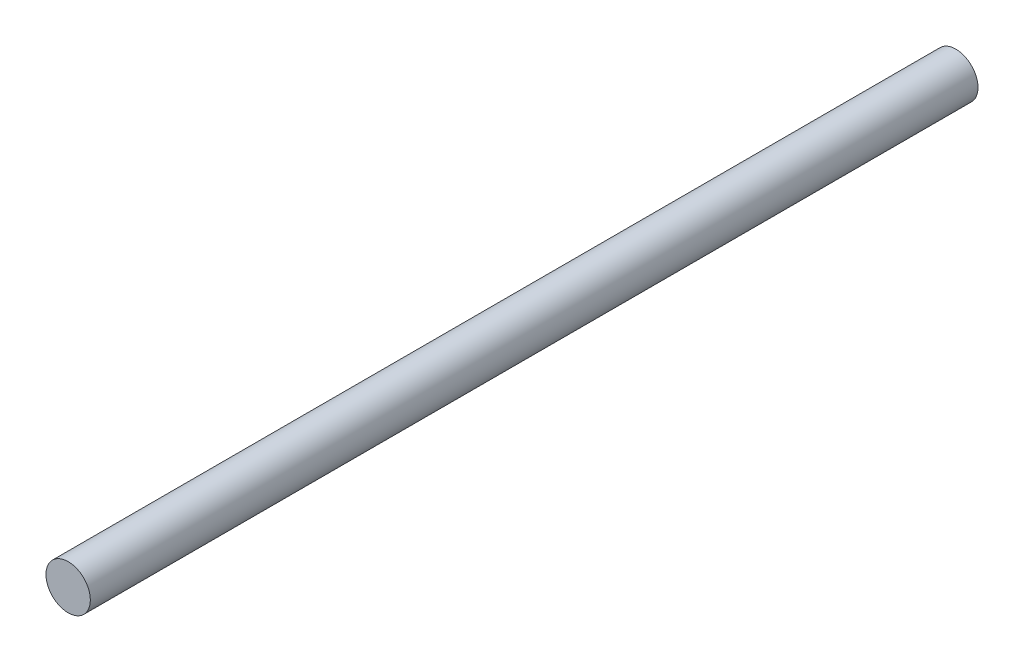
ISO-10303-21;
HEADER;
FILE_DESCRIPTION(('STEP AP214'),'2;1');
FILE_NAME('part.step','',(''),(''),'','','');
FILE_SCHEMA(('AUTOMOTIVE_DESIGN { 1 0 10303 214 1 1 1 1 }'));
ENDSEC;
DATA;
#1=APPLICATION_CONTEXT('core data for automotive mechanical design processes');
#2=APPLICATION_PROTOCOL_DEFINITION('international standard','automotive_design',2000,#1);
#3=PRODUCT_CONTEXT('',#1,'mechanical');
#4=PRODUCT('Part','Part','',(#3));
#5=PRODUCT_RELATED_PRODUCT_CATEGORY('part','',(#4));
#6=PRODUCT_DEFINITION_FORMATION('','',#4);
#7=PRODUCT_DEFINITION_CONTEXT('part definition',#1,'design');
#8=PRODUCT_DEFINITION('design','',#6,#7);
#9=PRODUCT_DEFINITION_SHAPE('','',#8);
#10=(LENGTH_UNIT() NAMED_UNIT(*) SI_UNIT(.MILLI.,.METRE.));
#11=(NAMED_UNIT(*) PLANE_ANGLE_UNIT() SI_UNIT($,.RADIAN.));
#12=(NAMED_UNIT(*) SI_UNIT($,.STERADIAN.) SOLID_ANGLE_UNIT());
#13=UNCERTAINTY_MEASURE_WITH_UNIT(LENGTH_MEASURE(1.E-05),#10,'distance_accuracy_value','');
#14=(GEOMETRIC_REPRESENTATION_CONTEXT(3) GLOBAL_UNCERTAINTY_ASSIGNED_CONTEXT((#13)) GLOBAL_UNIT_ASSIGNED_CONTEXT((#10,
#11,#12)) REPRESENTATION_CONTEXT('',''));
#15=CARTESIAN_POINT('',(0.,0.,0.));
#16=DIRECTION('',(0.,0.,1.));
#17=DIRECTION('',(1.,0.,0.));
#18=AXIS2_PLACEMENT_3D('',#15,#16,#17);
#19=CARTESIAN_POINT('',(0.,0.,-500.));
#20=DIRECTION('',(0.,0.,1.));
#21=DIRECTION('',(1.,0.,0.));
#22=AXIS2_PLACEMENT_3D('',#19,#20,#21);
#23=CYLINDRICAL_SURFACE('',#22,12.5);
#24=CARTESIAN_POINT('',(0.,0.,-500.));
#25=DIRECTION('',(0.,0.,1.));
#26=DIRECTION('',(1.,0.,0.));
#27=AXIS2_PLACEMENT_3D('',#24,#25,#26);
#28=CIRCLE('',#27,12.5);
#29=CARTESIAN_POINT('',(12.5,0.,-500.));
#30=VERTEX_POINT('',#29);
#31=EDGE_CURVE('E10',#30,#30,#28,.T.);
#32=ORIENTED_EDGE('',*,*,#31,.T.);
#33=EDGE_LOOP('',(#32));
#34=FACE_BOUND('',#33,.T.);
#35=CARTESIAN_POINT('',(0.,0.,0.));
#36=DIRECTION('',(0.,0.,1.));
#37=DIRECTION('',(1.,0.,0.));
#38=AXIS2_PLACEMENT_3D('',#35,#36,#37);
#39=CIRCLE('',#38,12.5);
#40=CARTESIAN_POINT('',(12.5,0.,0.));
#41=VERTEX_POINT('',#40);
#42=EDGE_CURVE('E41',#41,#41,#39,.T.);
#43=ORIENTED_EDGE('',*,*,#42,.F.);
#44=EDGE_LOOP('',(#43));
#45=FACE_BOUND('',#44,.T.);
#46=ADVANCED_FACE('F38',(#34,#45),#23,.T.);
#47=CARTESIAN_POINT('',(0.,0.,-500.));
#48=DIRECTION('',(0.,0.,1.));
#49=DIRECTION('',(1.,0.,0.));
#50=AXIS2_PLACEMENT_3D('',#47,#48,#49);
#51=PLANE('',#50);
#52=ORIENTED_EDGE('',*,*,#31,.F.);
#53=EDGE_LOOP('',(#52));
#54=FACE_BOUND('',#53,.T.);
#55=ADVANCED_FACE('F53',(#54),#51,.F.);
#56=CARTESIAN_POINT('',(0.,0.,0.));
#57=DIRECTION('',(0.,0.,1.));
#58=DIRECTION('',(1.,0.,0.));
#59=AXIS2_PLACEMENT_3D('',#56,#57,#58);
#60=PLANE('',#59);
#61=ORIENTED_EDGE('',*,*,#42,.T.);
#62=EDGE_LOOP('',(#61));
#63=FACE_BOUND('',#62,.T.);
#64=ADVANCED_FACE('F50',(#63),#60,.T.);
#65=CLOSED_SHELL('',(#46,#55,#64));
#66=MANIFOLD_SOLID_BREP('B2',#65);
#67=ADVANCED_BREP_SHAPE_REPRESENTATION('',(#18,#66),#14);
#68=SHAPE_DEFINITION_REPRESENTATION(#9,#67);
ENDSEC;
END-ISO-10303-21;
